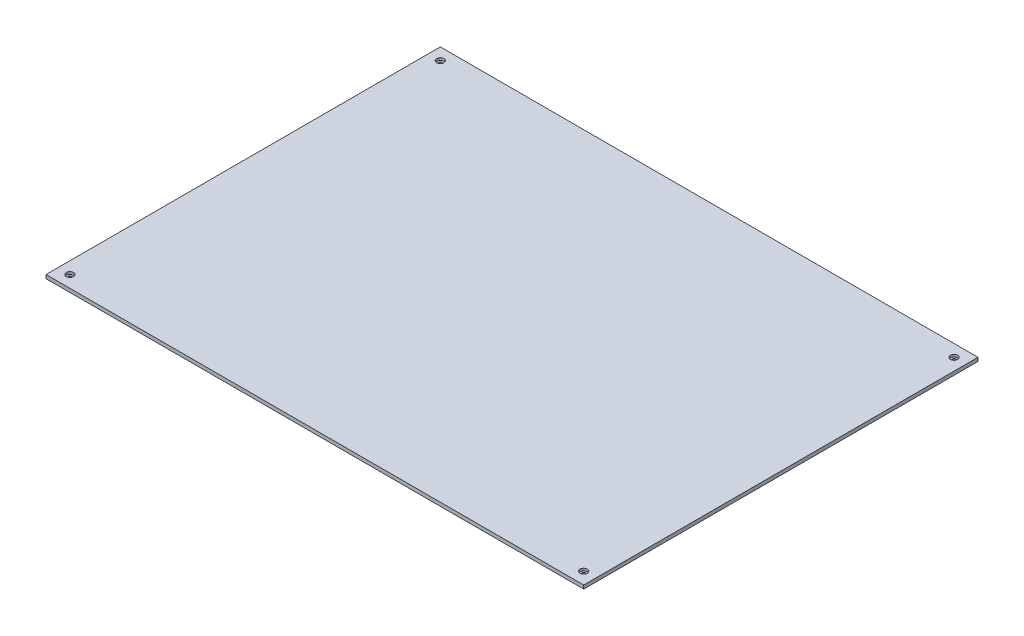
ISO-10303-21;
HEADER;
FILE_DESCRIPTION(('STEP AP214'),'2;1');
FILE_NAME('part.step','',(''),(''),'','','');
FILE_SCHEMA(('AUTOMOTIVE_DESIGN { 1 0 10303 214 1 1 1 1 }'));
ENDSEC;
DATA;
#1=APPLICATION_CONTEXT('core data for automotive mechanical design processes');
#2=APPLICATION_PROTOCOL_DEFINITION('international standard','automotive_design',2000,#1);
#3=PRODUCT_CONTEXT('',#1,'mechanical');
#4=PRODUCT('Part','Part','',(#3));
#5=PRODUCT_RELATED_PRODUCT_CATEGORY('part','',(#4));
#6=PRODUCT_DEFINITION_FORMATION('','',#4);
#7=PRODUCT_DEFINITION_CONTEXT('part definition',#1,'design');
#8=PRODUCT_DEFINITION('design','',#6,#7);
#9=PRODUCT_DEFINITION_SHAPE('','',#8);
#10=(LENGTH_UNIT() NAMED_UNIT(*) SI_UNIT(.MILLI.,.METRE.));
#11=(NAMED_UNIT(*) PLANE_ANGLE_UNIT() SI_UNIT($,.RADIAN.));
#12=(NAMED_UNIT(*) SI_UNIT($,.STERADIAN.) SOLID_ANGLE_UNIT());
#13=UNCERTAINTY_MEASURE_WITH_UNIT(LENGTH_MEASURE(1.E-05),#10,'distance_accuracy_value','');
#14=(GEOMETRIC_REPRESENTATION_CONTEXT(3) GLOBAL_UNCERTAINTY_ASSIGNED_CONTEXT((#13)) GLOBAL_UNIT_ASSIGNED_CONTEXT((#10,
#11,#12)) REPRESENTATION_CONTEXT('',''));
#15=CARTESIAN_POINT('',(0.,0.,0.));
#16=DIRECTION('',(0.,0.,1.));
#17=DIRECTION('',(1.,0.,0.));
#18=AXIS2_PLACEMENT_3D('',#15,#16,#17);
#19=CARTESIAN_POINT('',(-215.,3.,-155.));
#20=DIRECTION('',(0.,-1.,0.));
#21=DIRECTION('',(0.,0.,-1.));
#22=AXIS2_PLACEMENT_3D('',#19,#20,#21);
#23=CYLINDRICAL_SURFACE('',#22,1.54999999999999);
#24=CARTESIAN_POINT('',(-215.,0.,-155.));
#25=DIRECTION('',(0.,1.,0.));
#26=DIRECTION('',(0.,0.,1.));
#27=AXIS2_PLACEMENT_3D('',#24,#25,#26);
#28=CIRCLE('',#27,1.54999999999999);
#29=CARTESIAN_POINT('',(-215.,0.,-153.45));
#30=VERTEX_POINT('',#29);
#31=EDGE_CURVE('E136',#30,#30,#28,.T.);
#32=ORIENTED_EDGE('',*,*,#31,.F.);
#33=EDGE_LOOP('',(#32));
#34=FACE_BOUND('',#33,.T.);
#35=CARTESIAN_POINT('',(-215.,1.,-155.));
#36=DIRECTION('',(0.,1.,0.));
#37=DIRECTION('',(0.,0.,1.));
#38=AXIS2_PLACEMENT_3D('',#35,#36,#37);
#39=CIRCLE('',#38,1.54999999999999);
#40=CARTESIAN_POINT('',(-215.,1.,-153.45));
#41=VERTEX_POINT('',#40);
#42=EDGE_CURVE('E162',#41,#41,#39,.T.);
#43=ORIENTED_EDGE('',*,*,#42,.T.);
#44=EDGE_LOOP('',(#43));
#45=FACE_BOUND('',#44,.T.);
#46=ADVANCED_FACE('F57',(#34,#45),#23,.F.);
#47=CARTESIAN_POINT('',(214.999999999999,3.,-155.000000000001));
#48=DIRECTION('',(0.,-1.,0.));
#49=DIRECTION('',(0.,0.,-1.));
#50=AXIS2_PLACEMENT_3D('',#47,#48,#49);
#51=CYLINDRICAL_SURFACE('',#50,1.54999999999999);
#52=CARTESIAN_POINT('',(214.999999999999,0.,-155.000000000001));
#53=DIRECTION('',(0.,1.,0.));
#54=DIRECTION('',(0.,0.,1.));
#55=AXIS2_PLACEMENT_3D('',#52,#53,#54);
#56=CIRCLE('',#55,1.54999999999999);
#57=CARTESIAN_POINT('',(214.999999999999,0.,-153.450000000001));
#58=VERTEX_POINT('',#57);
#59=EDGE_CURVE('E133',#58,#58,#56,.F.);
#60=ORIENTED_EDGE('',*,*,#59,.T.);
#61=EDGE_LOOP('',(#60));
#62=FACE_BOUND('',#61,.T.);
#63=CARTESIAN_POINT('',(214.999999999999,1.,-155.000000000001));
#64=DIRECTION('',(0.,1.,0.));
#65=DIRECTION('',(0.,0.,1.));
#66=AXIS2_PLACEMENT_3D('',#63,#64,#65);
#67=CIRCLE('',#66,1.54999999999999);
#68=CARTESIAN_POINT('',(214.999999999999,1.,-153.450000000001));
#69=VERTEX_POINT('',#68);
#70=EDGE_CURVE('E176',#69,#69,#67,.T.);
#71=ORIENTED_EDGE('',*,*,#70,.T.);
#72=EDGE_LOOP('',(#71));
#73=FACE_BOUND('',#72,.T.);
#74=ADVANCED_FACE('F182',(#62,#73),#51,.F.);
#75=CARTESIAN_POINT('',(-215.,3.,155.));
#76=DIRECTION('',(0.,-1.,0.));
#77=DIRECTION('',(0.,0.,-1.));
#78=AXIS2_PLACEMENT_3D('',#75,#76,#77);
#79=CYLINDRICAL_SURFACE('',#78,1.54999999999999);
#80=CARTESIAN_POINT('',(-215.,0.,155.));
#81=DIRECTION('',(0.,1.,0.));
#82=DIRECTION('',(0.,0.,1.));
#83=AXIS2_PLACEMENT_3D('',#80,#81,#82);
#84=CIRCLE('',#83,1.54999999999999);
#85=CARTESIAN_POINT('',(-215.,0.,156.55));
#86=VERTEX_POINT('',#85);
#87=EDGE_CURVE('E130',#86,#86,#84,.F.);
#88=ORIENTED_EDGE('',*,*,#87,.T.);
#89=EDGE_LOOP('',(#88));
#90=FACE_BOUND('',#89,.T.);
#91=CARTESIAN_POINT('',(-215.,1.,155.));
#92=DIRECTION('',(0.,1.,0.));
#93=DIRECTION('',(0.,0.,1.));
#94=AXIS2_PLACEMENT_3D('',#91,#92,#93);
#95=CIRCLE('',#94,1.54999999999999);
#96=CARTESIAN_POINT('',(-215.,1.,156.55));
#97=VERTEX_POINT('',#96);
#98=EDGE_CURVE('E149',#97,#97,#95,.T.);
#99=ORIENTED_EDGE('',*,*,#98,.T.);
#100=EDGE_LOOP('',(#99));
#101=FACE_BOUND('',#100,.T.);
#102=ADVANCED_FACE('F225',(#90,#101),#79,.F.);
#103=CARTESIAN_POINT('',(214.999999999999,3.,155.000000000001));
#104=DIRECTION('',(0.,-1.,0.));
#105=DIRECTION('',(0.,0.,-1.));
#106=AXIS2_PLACEMENT_3D('',#103,#104,#105);
#107=CYLINDRICAL_SURFACE('',#106,1.54999999999999);
#108=CARTESIAN_POINT('',(214.999999999999,0.,155.000000000001));
#109=DIRECTION('',(0.,1.,0.));
#110=DIRECTION('',(0.,0.,1.));
#111=AXIS2_PLACEMENT_3D('',#108,#109,#110);
#112=CIRCLE('',#111,1.54999999999999);
#113=CARTESIAN_POINT('',(214.999999999999,0.,156.550000000001));
#114=VERTEX_POINT('',#113);
#115=EDGE_CURVE('E139',#114,#114,#112,.T.);
#116=ORIENTED_EDGE('',*,*,#115,.F.);
#117=EDGE_LOOP('',(#116));
#118=FACE_BOUND('',#117,.T.);
#119=CARTESIAN_POINT('',(214.999999999999,1.,155.000000000001));
#120=DIRECTION('',(0.,1.,0.));
#121=DIRECTION('',(0.,0.,1.));
#122=AXIS2_PLACEMENT_3D('',#119,#120,#121);
#123=CIRCLE('',#122,1.54999999999999);
#124=CARTESIAN_POINT('',(214.999999999999,1.,156.550000000001));
#125=VERTEX_POINT('',#124);
#126=EDGE_CURVE('E159',#125,#125,#123,.T.);
#127=ORIENTED_EDGE('',*,*,#126,.T.);
#128=EDGE_LOOP('',(#127));
#129=FACE_BOUND('',#128,.T.);
#130=ADVANCED_FACE('F231',(#118,#129),#107,.F.);
#131=CARTESIAN_POINT('',(0.,3.,165.));
#132=DIRECTION('',(0.,0.,-1.));
#133=DIRECTION('',(-1.,0.,0.));
#134=AXIS2_PLACEMENT_3D('',#131,#132,#133);
#135=PLANE('',#134);
#136=DIRECTION('',(1.,0.,0.));
#137=VECTOR('',#136,1.);
#138=CARTESIAN_POINT('',(0.,0.,165.));
#139=LINE('',#138,#137);
#140=CARTESIAN_POINT('',(-225.,0.,165.));
#141=VERTEX_POINT('',#140);
#142=CARTESIAN_POINT('',(225.,0.,165.));
#143=VERTEX_POINT('',#142);
#144=EDGE_CURVE('E121',#141,#143,#139,.T.);
#145=ORIENTED_EDGE('',*,*,#144,.T.);
#146=DIRECTION('',(0.,-1.,0.));
#147=VECTOR('',#146,1.);
#148=CARTESIAN_POINT('',(225.,3.,165.));
#149=LINE('',#148,#147);
#150=CARTESIAN_POINT('',(225.,3.,165.));
#151=VERTEX_POINT('',#150);
#152=EDGE_CURVE('E12',#151,#143,#149,.T.);
#153=ORIENTED_EDGE('',*,*,#152,.F.);
#154=DIRECTION('',(1.,0.,0.));
#155=VECTOR('',#154,1.);
#156=CARTESIAN_POINT('',(0.,3.,165.));
#157=LINE('',#156,#155);
#158=CARTESIAN_POINT('',(-225.,3.,165.));
#159=VERTEX_POINT('',#158);
#160=EDGE_CURVE('E107',#159,#151,#157,.T.);
#161=ORIENTED_EDGE('',*,*,#160,.F.);
#162=DIRECTION('',(0.,-1.,0.));
#163=VECTOR('',#162,1.);
#164=CARTESIAN_POINT('',(-225.,3.,165.));
#165=LINE('',#164,#163);
#166=EDGE_CURVE('E74',#159,#141,#165,.T.);
#167=ORIENTED_EDGE('',*,*,#166,.T.);
#168=EDGE_LOOP('',(#145,#153,#161,#167));
#169=FACE_BOUND('',#168,.T.);
#170=ADVANCED_FACE('F59',(#169),#135,.F.);
#171=CARTESIAN_POINT('',(225.,3.,0.));
#172=DIRECTION('',(-1.,0.,0.));
#173=DIRECTION('',(0.,0.,1.));
#174=AXIS2_PLACEMENT_3D('',#171,#172,#173);
#175=PLANE('',#174);
#176=DIRECTION('',(0.,0.,-1.));
#177=VECTOR('',#176,1.);
#178=CARTESIAN_POINT('',(225.,0.,0.));
#179=LINE('',#178,#177);
#180=CARTESIAN_POINT('',(225.,0.,-165.));
#181=VERTEX_POINT('',#180);
#182=EDGE_CURVE('E112',#143,#181,#179,.T.);
#183=ORIENTED_EDGE('',*,*,#182,.T.);
#184=DIRECTION('',(0.,-1.,0.));
#185=VECTOR('',#184,1.);
#186=CARTESIAN_POINT('',(225.,3.,-165.));
#187=LINE('',#186,#185);
#188=CARTESIAN_POINT('',(225.,3.,-165.));
#189=VERTEX_POINT('',#188);
#190=EDGE_CURVE('E66',#189,#181,#187,.T.);
#191=ORIENTED_EDGE('',*,*,#190,.F.);
#192=DIRECTION('',(0.,0.,-1.));
#193=VECTOR('',#192,1.);
#194=CARTESIAN_POINT('',(225.,3.,0.));
#195=LINE('',#194,#193);
#196=EDGE_CURVE('E99',#151,#189,#195,.T.);
#197=ORIENTED_EDGE('',*,*,#196,.F.);
#198=ORIENTED_EDGE('',*,*,#152,.T.);
#199=EDGE_LOOP('',(#183,#191,#197,#198));
#200=FACE_BOUND('',#199,.T.);
#201=ADVANCED_FACE('F111',(#200),#175,.F.);
#202=CARTESIAN_POINT('',(0.,3.,-165.));
#203=DIRECTION('',(0.,0.,-1.));
#204=DIRECTION('',(-1.,0.,0.));
#205=AXIS2_PLACEMENT_3D('',#202,#203,#204);
#206=PLANE('',#205);
#207=DIRECTION('',(1.,0.,0.));
#208=VECTOR('',#207,1.);
#209=CARTESIAN_POINT('',(0.,0.,-165.));
#210=LINE('',#209,#208);
#211=CARTESIAN_POINT('',(-225.,0.,-165.));
#212=VERTEX_POINT('',#211);
#213=EDGE_CURVE('E125',#212,#181,#210,.T.);
#214=ORIENTED_EDGE('',*,*,#213,.F.);
#215=DIRECTION('',(0.,-1.,0.));
#216=VECTOR('',#215,1.);
#217=CARTESIAN_POINT('',(-225.,3.,-165.));
#218=LINE('',#217,#216);
#219=CARTESIAN_POINT('',(-225.,3.,-165.));
#220=VERTEX_POINT('',#219);
#221=EDGE_CURVE('E88',#220,#212,#218,.T.);
#222=ORIENTED_EDGE('',*,*,#221,.F.);
#223=DIRECTION('',(1.,0.,0.));
#224=VECTOR('',#223,1.);
#225=CARTESIAN_POINT('',(0.,3.,-165.));
#226=LINE('',#225,#224);
#227=EDGE_CURVE('E106',#220,#189,#226,.T.);
#228=ORIENTED_EDGE('',*,*,#227,.T.);
#229=ORIENTED_EDGE('',*,*,#190,.T.);
#230=EDGE_LOOP('',(#214,#222,#228,#229));
#231=FACE_BOUND('',#230,.T.);
#232=ADVANCED_FACE('F115',(#231),#206,.T.);
#233=CARTESIAN_POINT('',(-225.,3.,0.));
#234=DIRECTION('',(-1.,0.,0.));
#235=DIRECTION('',(0.,0.,1.));
#236=AXIS2_PLACEMENT_3D('',#233,#234,#235);
#237=PLANE('',#236);
#238=DIRECTION('',(0.,0.,-1.));
#239=VECTOR('',#238,1.);
#240=CARTESIAN_POINT('',(-225.,0.,0.));
#241=LINE('',#240,#239);
#242=EDGE_CURVE('E127',#141,#212,#241,.T.);
#243=ORIENTED_EDGE('',*,*,#242,.F.);
#244=ORIENTED_EDGE('',*,*,#166,.F.);
#245=DIRECTION('',(0.,0.,-1.));
#246=VECTOR('',#245,1.);
#247=CARTESIAN_POINT('',(-225.,3.,0.));
#248=LINE('',#247,#246);
#249=EDGE_CURVE('E116',#159,#220,#248,.T.);
#250=ORIENTED_EDGE('',*,*,#249,.T.);
#251=ORIENTED_EDGE('',*,*,#221,.T.);
#252=EDGE_LOOP('',(#243,#244,#250,#251));
#253=FACE_BOUND('',#252,.T.);
#254=ADVANCED_FACE('F201',(#253),#237,.T.);
#255=CARTESIAN_POINT('',(0.,3.,0.));
#256=DIRECTION('',(0.,1.,0.));
#257=DIRECTION('',(0.,0.,1.));
#258=AXIS2_PLACEMENT_3D('',#255,#256,#257);
#259=PLANE('',#258);
#260=CARTESIAN_POINT('',(-215.,3.,-155.));
#261=DIRECTION('',(0.,1.,0.));
#262=DIRECTION('',(0.,0.,1.));
#263=AXIS2_PLACEMENT_3D('',#260,#261,#262);
#264=CIRCLE('',#263,3.04999999999999);
#265=CARTESIAN_POINT('',(-215.,3.,-151.95));
#266=VERTEX_POINT('',#265);
#267=EDGE_CURVE('E166',#266,#266,#264,.T.);
#268=ORIENTED_EDGE('',*,*,#267,.F.);
#269=EDGE_LOOP('',(#268));
#270=FACE_BOUND('',#269,.T.);
#271=CARTESIAN_POINT('',(214.999999999999,3.,155.000000000001));
#272=DIRECTION('',(0.,1.,0.));
#273=DIRECTION('',(0.,0.,1.));
#274=AXIS2_PLACEMENT_3D('',#271,#272,#273);
#275=CIRCLE('',#274,3.04999999999999);
#276=CARTESIAN_POINT('',(214.999999999999,3.,158.050000000001));
#277=VERTEX_POINT('',#276);
#278=EDGE_CURVE('E155',#277,#277,#275,.T.);
#279=ORIENTED_EDGE('',*,*,#278,.F.);
#280=EDGE_LOOP('',(#279));
#281=FACE_BOUND('',#280,.T.);
#282=CARTESIAN_POINT('',(214.999999999999,3.,-155.000000000001));
#283=DIRECTION('',(0.,1.,0.));
#284=DIRECTION('',(0.,0.,1.));
#285=AXIS2_PLACEMENT_3D('',#282,#283,#284);
#286=CIRCLE('',#285,3.04999999999999);
#287=CARTESIAN_POINT('',(214.999999999999,3.,-151.950000000001));
#288=VERTEX_POINT('',#287);
#289=EDGE_CURVE('E173',#288,#288,#286,.T.);
#290=ORIENTED_EDGE('',*,*,#289,.F.);
#291=EDGE_LOOP('',(#290));
#292=FACE_BOUND('',#291,.T.);
#293=CARTESIAN_POINT('',(-215.,3.,155.));
#294=DIRECTION('',(0.,1.,0.));
#295=DIRECTION('',(0.,0.,1.));
#296=AXIS2_PLACEMENT_3D('',#293,#294,#295);
#297=CIRCLE('',#296,3.04999999999999);
#298=CARTESIAN_POINT('',(-215.,3.,158.05));
#299=VERTEX_POINT('',#298);
#300=EDGE_CURVE('E146',#299,#299,#297,.T.);
#301=ORIENTED_EDGE('',*,*,#300,.F.);
#302=EDGE_LOOP('',(#301));
#303=FACE_BOUND('',#302,.T.);
#304=ORIENTED_EDGE('',*,*,#160,.T.);
#305=ORIENTED_EDGE('',*,*,#196,.T.);
#306=ORIENTED_EDGE('',*,*,#227,.F.);
#307=ORIENTED_EDGE('',*,*,#249,.F.);
#308=EDGE_LOOP('',(#304,#305,#306,#307));
#309=FACE_BOUND('',#308,.T.);
#310=ADVANCED_FACE('F103',(#270,#281,#292,#303,#309),#259,.T.);
#311=CARTESIAN_POINT('',(0.,0.,0.));
#312=DIRECTION('',(0.,1.,0.));
#313=DIRECTION('',(0.,0.,1.));
#314=AXIS2_PLACEMENT_3D('',#311,#312,#313);
#315=PLANE('',#314);
#316=ORIENTED_EDGE('',*,*,#144,.F.);
#317=ORIENTED_EDGE('',*,*,#242,.T.);
#318=ORIENTED_EDGE('',*,*,#213,.T.);
#319=ORIENTED_EDGE('',*,*,#182,.F.);
#320=EDGE_LOOP('',(#316,#317,#318,#319));
#321=FACE_BOUND('',#320,.T.);
#322=ORIENTED_EDGE('',*,*,#87,.F.);
#323=EDGE_LOOP('',(#322));
#324=FACE_BOUND('',#323,.T.);
#325=ORIENTED_EDGE('',*,*,#59,.F.);
#326=EDGE_LOOP('',(#325));
#327=FACE_BOUND('',#326,.T.);
#328=ORIENTED_EDGE('',*,*,#31,.T.);
#329=EDGE_LOOP('',(#328));
#330=FACE_BOUND('',#329,.T.);
#331=ORIENTED_EDGE('',*,*,#115,.T.);
#332=EDGE_LOOP('',(#331));
#333=FACE_BOUND('',#332,.T.);
#334=ADVANCED_FACE('F200',(#321,#324,#327,#330,#333),#315,.F.);
#335=CARTESIAN_POINT('',(-215.,1.,155.));
#336=DIRECTION('',(0.,1.,0.));
#337=DIRECTION('',(0.,0.,1.));
#338=AXIS2_PLACEMENT_3D('',#335,#336,#337);
#339=CYLINDRICAL_SURFACE('',#338,3.04999999999999);
#340=CARTESIAN_POINT('',(-215.,1.,155.));
#341=DIRECTION('',(0.,1.,0.));
#342=DIRECTION('',(0.,0.,1.));
#343=AXIS2_PLACEMENT_3D('',#340,#341,#342);
#344=CIRCLE('',#343,3.04999999999999);
#345=CARTESIAN_POINT('',(-215.,1.,158.05));
#346=VERTEX_POINT('',#345);
#347=EDGE_CURVE('E123',#346,#346,#344,.T.);
#348=ORIENTED_EDGE('',*,*,#347,.F.);
#349=EDGE_LOOP('',(#348));
#350=FACE_BOUND('',#349,.T.);
#351=ORIENTED_EDGE('',*,*,#300,.T.);
#352=EDGE_LOOP('',(#351));
#353=FACE_BOUND('',#352,.T.);
#354=ADVANCED_FACE('F206',(#350,#353),#339,.F.);
#355=CARTESIAN_POINT('',(-215.,1.,155.));
#356=DIRECTION('',(0.,1.,0.));
#357=DIRECTION('',(0.,0.,1.));
#358=AXIS2_PLACEMENT_3D('',#355,#356,#357);
#359=PLANE('',#358);
#360=ORIENTED_EDGE('',*,*,#98,.F.);
#361=EDGE_LOOP('',(#360));
#362=FACE_BOUND('',#361,.T.);
#363=ORIENTED_EDGE('',*,*,#347,.T.);
#364=EDGE_LOOP('',(#363));
#365=FACE_BOUND('',#364,.T.);
#366=ADVANCED_FACE('F194',(#362,#365),#359,.T.);
#367=CARTESIAN_POINT('',(214.999999999999,1.,-155.000000000001));
#368=DIRECTION('',(0.,1.,0.));
#369=DIRECTION('',(0.,0.,1.));
#370=AXIS2_PLACEMENT_3D('',#367,#368,#369);
#371=CYLINDRICAL_SURFACE('',#370,3.04999999999999);
#372=CARTESIAN_POINT('',(214.999999999999,1.,-155.000000000001));
#373=DIRECTION('',(0.,1.,0.));
#374=DIRECTION('',(0.,0.,1.));
#375=AXIS2_PLACEMENT_3D('',#372,#373,#374);
#376=CIRCLE('',#375,3.04999999999999);
#377=CARTESIAN_POINT('',(214.999999999999,1.,-151.950000000001));
#378=VERTEX_POINT('',#377);
#379=EDGE_CURVE('E165',#378,#378,#376,.T.);
#380=ORIENTED_EDGE('',*,*,#379,.F.);
#381=EDGE_LOOP('',(#380));
#382=FACE_BOUND('',#381,.T.);
#383=ORIENTED_EDGE('',*,*,#289,.T.);
#384=EDGE_LOOP('',(#383));
#385=FACE_BOUND('',#384,.T.);
#386=ADVANCED_FACE('F188',(#382,#385),#371,.F.);
#387=CARTESIAN_POINT('',(214.999999999999,1.,-155.000000000001));
#388=DIRECTION('',(0.,1.,0.));
#389=DIRECTION('',(0.,0.,1.));
#390=AXIS2_PLACEMENT_3D('',#387,#388,#389);
#391=PLANE('',#390);
#392=ORIENTED_EDGE('',*,*,#70,.F.);
#393=EDGE_LOOP('',(#392));
#394=FACE_BOUND('',#393,.T.);
#395=ORIENTED_EDGE('',*,*,#379,.T.);
#396=EDGE_LOOP('',(#395));
#397=FACE_BOUND('',#396,.T.);
#398=ADVANCED_FACE('F184',(#394,#397),#391,.T.);
#399=CARTESIAN_POINT('',(214.999999999999,1.,155.000000000001));
#400=DIRECTION('',(0.,1.,0.));
#401=DIRECTION('',(0.,0.,1.));
#402=AXIS2_PLACEMENT_3D('',#399,#400,#401);
#403=CYLINDRICAL_SURFACE('',#402,3.04999999999999);
#404=CARTESIAN_POINT('',(214.999999999999,1.,155.000000000001));
#405=DIRECTION('',(0.,1.,0.));
#406=DIRECTION('',(0.,0.,1.));
#407=AXIS2_PLACEMENT_3D('',#404,#405,#406);
#408=CIRCLE('',#407,3.04999999999999);
#409=CARTESIAN_POINT('',(214.999999999999,1.,158.050000000001));
#410=VERTEX_POINT('',#409);
#411=EDGE_CURVE('E158',#410,#410,#408,.T.);
#412=ORIENTED_EDGE('',*,*,#411,.F.);
#413=EDGE_LOOP('',(#412));
#414=FACE_BOUND('',#413,.T.);
#415=ORIENTED_EDGE('',*,*,#278,.T.);
#416=EDGE_LOOP('',(#415));
#417=FACE_BOUND('',#416,.T.);
#418=ADVANCED_FACE('F187',(#414,#417),#403,.F.);
#419=CARTESIAN_POINT('',(214.999999999999,1.,155.000000000001));
#420=DIRECTION('',(0.,1.,0.));
#421=DIRECTION('',(0.,0.,1.));
#422=AXIS2_PLACEMENT_3D('',#419,#420,#421);
#423=PLANE('',#422);
#424=ORIENTED_EDGE('',*,*,#126,.F.);
#425=EDGE_LOOP('',(#424));
#426=FACE_BOUND('',#425,.T.);
#427=ORIENTED_EDGE('',*,*,#411,.T.);
#428=EDGE_LOOP('',(#427));
#429=FACE_BOUND('',#428,.T.);
#430=ADVANCED_FACE('F260',(#426,#429),#423,.T.);
#431=CARTESIAN_POINT('',(-215.,1.,-155.));
#432=DIRECTION('',(0.,1.,0.));
#433=DIRECTION('',(0.,0.,1.));
#434=AXIS2_PLACEMENT_3D('',#431,#432,#433);
#435=CYLINDRICAL_SURFACE('',#434,3.04999999999999);
#436=CARTESIAN_POINT('',(-215.,1.,-155.));
#437=DIRECTION('',(0.,1.,0.));
#438=DIRECTION('',(0.,0.,1.));
#439=AXIS2_PLACEMENT_3D('',#436,#437,#438);
#440=CIRCLE('',#439,3.04999999999999);
#441=CARTESIAN_POINT('',(-215.,1.,-151.95));
#442=VERTEX_POINT('',#441);
#443=EDGE_CURVE('E154',#442,#442,#440,.T.);
#444=ORIENTED_EDGE('',*,*,#443,.F.);
#445=EDGE_LOOP('',(#444));
#446=FACE_BOUND('',#445,.T.);
#447=ORIENTED_EDGE('',*,*,#267,.T.);
#448=EDGE_LOOP('',(#447));
#449=FACE_BOUND('',#448,.T.);
#450=ADVANCED_FACE('F263',(#446,#449),#435,.F.);
#451=CARTESIAN_POINT('',(-215.,1.,-155.));
#452=DIRECTION('',(0.,1.,0.));
#453=DIRECTION('',(0.,0.,1.));
#454=AXIS2_PLACEMENT_3D('',#451,#452,#453);
#455=PLANE('',#454);
#456=ORIENTED_EDGE('',*,*,#42,.F.);
#457=EDGE_LOOP('',(#456));
#458=FACE_BOUND('',#457,.T.);
#459=ORIENTED_EDGE('',*,*,#443,.T.);
#460=EDGE_LOOP('',(#459));
#461=FACE_BOUND('',#460,.T.);
#462=ADVANCED_FACE('F277',(#458,#461),#455,.T.);
#463=CLOSED_SHELL('',(#46,#74,#102,#130,#170,#201,#232,#254,#310,#334,#354,#366,#386,#398,#418,
#430,#450,#462));
#464=MANIFOLD_SOLID_BREP('B2',#463);
#465=ADVANCED_BREP_SHAPE_REPRESENTATION('',(#18,#464),#14);
#466=SHAPE_DEFINITION_REPRESENTATION(#9,#465);
ENDSEC;
END-ISO-10303-21;
